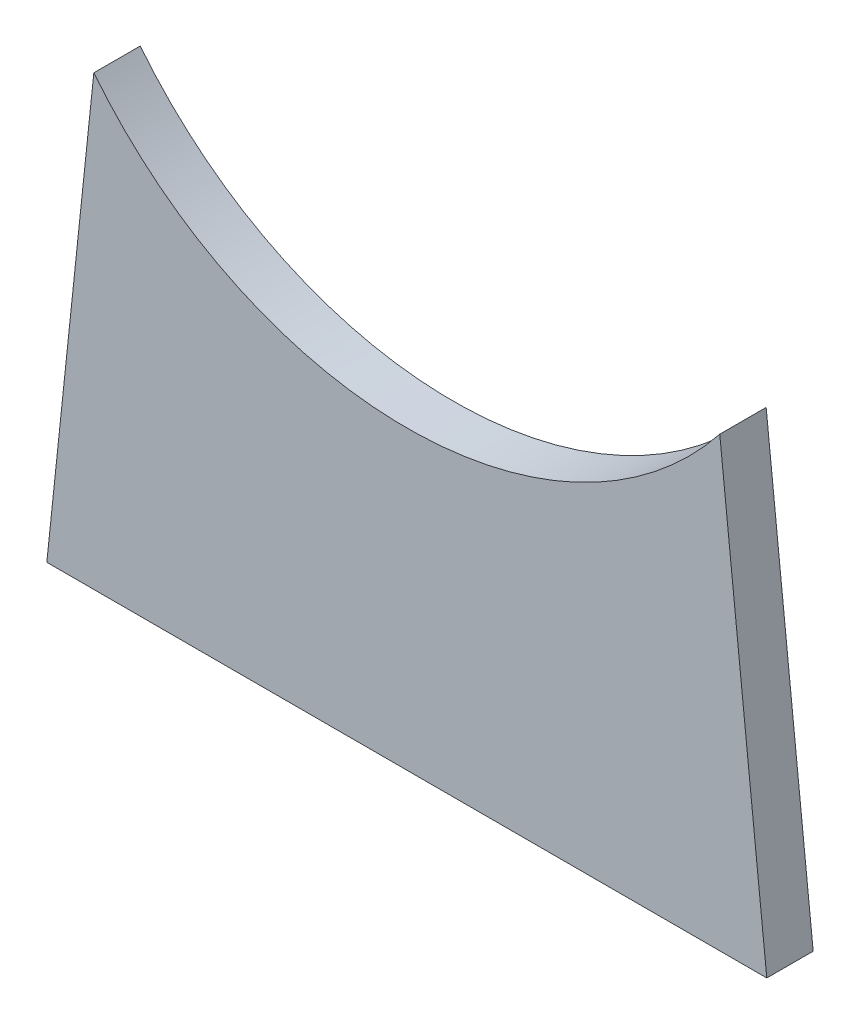
ISO-10303-21;
HEADER;
FILE_DESCRIPTION(('STEP AP214'),'2;1');
FILE_NAME('part.step','',(''),(''),'','','');
FILE_SCHEMA(('AUTOMOTIVE_DESIGN { 1 0 10303 214 1 1 1 1 }'));
ENDSEC;
DATA;
#1=APPLICATION_CONTEXT('core data for automotive mechanical design processes');
#2=APPLICATION_PROTOCOL_DEFINITION('international standard','automotive_design',2000,#1);
#3=PRODUCT_CONTEXT('',#1,'mechanical');
#4=PRODUCT('Part','Part','',(#3));
#5=PRODUCT_RELATED_PRODUCT_CATEGORY('part','',(#4));
#6=PRODUCT_DEFINITION_FORMATION('','',#4);
#7=PRODUCT_DEFINITION_CONTEXT('part definition',#1,'design');
#8=PRODUCT_DEFINITION('design','',#6,#7);
#9=PRODUCT_DEFINITION_SHAPE('','',#8);
#10=(LENGTH_UNIT() NAMED_UNIT(*) SI_UNIT(.MILLI.,.METRE.));
#11=(NAMED_UNIT(*) PLANE_ANGLE_UNIT() SI_UNIT($,.RADIAN.));
#12=(NAMED_UNIT(*) SI_UNIT($,.STERADIAN.) SOLID_ANGLE_UNIT());
#13=UNCERTAINTY_MEASURE_WITH_UNIT(LENGTH_MEASURE(1.E-05),#10,'distance_accuracy_value','');
#14=(GEOMETRIC_REPRESENTATION_CONTEXT(3) GLOBAL_UNCERTAINTY_ASSIGNED_CONTEXT((#13)) GLOBAL_UNIT_ASSIGNED_CONTEXT((#10,
#11,#12)) REPRESENTATION_CONTEXT('',''));
#15=CARTESIAN_POINT('',(0.,0.,0.));
#16=DIRECTION('',(0.,0.,1.));
#17=DIRECTION('',(1.,0.,0.));
#18=AXIS2_PLACEMENT_3D('',#15,#16,#17);
#19=CARTESIAN_POINT('',(-1978.13,0.,127.5));
#20=DIRECTION('',(0.994521895368273,-0.104528463267658,0.));
#21=DIRECTION('',(0.104528463267658,0.994521895368273,0.));
#22=AXIS2_PLACEMENT_3D('',#19,#20,#21);
#23=PLANE('',#22);
#24=DIRECTION('',(-0.104528463267658,-0.994521895368273,0.));
#25=VECTOR('',#24,1.);
#26=CARTESIAN_POINT('',(-1978.13,0.,-127.5));
#27=LINE('',#26,#25);
#28=CARTESIAN_POINT('',(-1719.70496154051,2458.75,-127.5));
#29=VERTEX_POINT('',#28);
#30=CARTESIAN_POINT('',(-1978.13,0.,-127.5));
#31=VERTEX_POINT('',#30);
#32=EDGE_CURVE('E107',#29,#31,#27,.T.);
#33=ORIENTED_EDGE('',*,*,#32,.T.);
#34=DIRECTION('',(0.,0.,-1.));
#35=VECTOR('',#34,1.);
#36=CARTESIAN_POINT('',(-1978.13,0.,127.5));
#37=LINE('',#36,#35);
#38=CARTESIAN_POINT('',(-1978.13,0.,127.5));
#39=VERTEX_POINT('',#38);
#40=EDGE_CURVE('E11',#39,#31,#37,.T.);
#41=ORIENTED_EDGE('',*,*,#40,.F.);
#42=DIRECTION('',(-0.104528463267658,-0.994521895368273,0.));
#43=VECTOR('',#42,1.);
#44=CARTESIAN_POINT('',(-1978.13,0.,127.5));
#45=LINE('',#44,#43);
#46=CARTESIAN_POINT('',(-1719.70496154051,2458.75,127.5));
#47=VERTEX_POINT('',#46);
#48=EDGE_CURVE('E91',#47,#39,#45,.T.);
#49=ORIENTED_EDGE('',*,*,#48,.F.);
#50=DIRECTION('',(0.,0.,-1.));
#51=VECTOR('',#50,1.);
#52=CARTESIAN_POINT('',(-1719.70496154051,2458.75,127.5));
#53=LINE('',#52,#51);
#54=EDGE_CURVE('E103',#47,#29,#53,.T.);
#55=ORIENTED_EDGE('',*,*,#54,.T.);
#56=EDGE_LOOP('',(#33,#41,#49,#55));
#57=FACE_BOUND('',#56,.T.);
#58=ADVANCED_FACE('F39',(#57),#23,.F.);
#59=CARTESIAN_POINT('',(-1978.13,0.,127.5));
#60=DIRECTION('',(0.,1.,0.));
#61=DIRECTION('',(-1.,0.,0.));
#62=AXIS2_PLACEMENT_3D('',#59,#60,#61);
#63=PLANE('',#62);
#64=DIRECTION('',(1.,0.,0.));
#65=VECTOR('',#64,1.);
#66=CARTESIAN_POINT('',(-1978.13,0.,-127.5));
#67=LINE('',#66,#65);
#68=CARTESIAN_POINT('',(1978.13,4.84502114559471E-13,-127.5));
#69=VERTEX_POINT('',#68);
#70=EDGE_CURVE('E96',#31,#69,#67,.T.);
#71=ORIENTED_EDGE('',*,*,#70,.T.);
#72=DIRECTION('',(0.,0.,-1.));
#73=VECTOR('',#72,1.);
#74=CARTESIAN_POINT('',(1978.13,4.84502114559471E-13,127.5));
#75=LINE('',#74,#73);
#76=CARTESIAN_POINT('',(1978.13,4.84502114559471E-13,127.5));
#77=VERTEX_POINT('',#76);
#78=EDGE_CURVE('E48',#77,#69,#75,.T.);
#79=ORIENTED_EDGE('',*,*,#78,.F.);
#80=DIRECTION('',(1.,0.,0.));
#81=VECTOR('',#80,1.);
#82=CARTESIAN_POINT('',(-1978.13,0.,127.5));
#83=LINE('',#82,#81);
#84=EDGE_CURVE('E86',#39,#77,#83,.T.);
#85=ORIENTED_EDGE('',*,*,#84,.F.);
#86=ORIENTED_EDGE('',*,*,#40,.T.);
#87=EDGE_LOOP('',(#71,#79,#85,#86));
#88=FACE_BOUND('',#87,.T.);
#89=ADVANCED_FACE('F95',(#88),#63,.F.);
#90=CARTESIAN_POINT('',(1978.13,4.84502114559471E-13,127.5));
#91=DIRECTION('',(-0.994521895368273,-0.104528463267658,0.));
#92=DIRECTION('',(0.104528463267658,-0.994521895368273,0.));
#93=AXIS2_PLACEMENT_3D('',#90,#91,#92);
#94=PLANE('',#93);
#95=DIRECTION('',(-0.104528463267658,0.994521895368273,0.));
#96=VECTOR('',#95,1.);
#97=CARTESIAN_POINT('',(1978.13,4.84502114559471E-13,-127.5));
#98=LINE('',#97,#96);
#99=CARTESIAN_POINT('',(1719.70496154051,2458.75,-127.5));
#100=VERTEX_POINT('',#99);
#101=EDGE_CURVE('E73',#69,#100,#98,.T.);
#102=ORIENTED_EDGE('',*,*,#101,.T.);
#103=DIRECTION('',(0.,0.,-1.));
#104=VECTOR('',#103,1.);
#105=CARTESIAN_POINT('',(1719.70496154051,2458.75,127.5));
#106=LINE('',#105,#104);
#107=CARTESIAN_POINT('',(1719.70496154051,2458.75,127.5));
#108=VERTEX_POINT('',#107);
#109=EDGE_CURVE('E98',#108,#100,#106,.T.);
#110=ORIENTED_EDGE('',*,*,#109,.F.);
#111=DIRECTION('',(-0.104528463267658,0.994521895368273,0.));
#112=VECTOR('',#111,1.);
#113=CARTESIAN_POINT('',(1978.13,4.84502114559471E-13,127.5));
#114=LINE('',#113,#112);
#115=EDGE_CURVE('E89',#77,#108,#114,.T.);
#116=ORIENTED_EDGE('',*,*,#115,.F.);
#117=ORIENTED_EDGE('',*,*,#78,.T.);
#118=EDGE_LOOP('',(#102,#110,#116,#117));
#119=FACE_BOUND('',#118,.T.);
#120=ADVANCED_FACE('F99',(#119),#94,.F.);
#121=CARTESIAN_POINT('',(2.22044604925031E-13,3824.44348158837,127.5));
#122=DIRECTION('',(0.,0.,-1.));
#123=DIRECTION('',(-1.,0.,0.));
#124=AXIS2_PLACEMENT_3D('',#121,#122,#123);
#125=CYLINDRICAL_SURFACE('',#124,2196.02);
#126=CARTESIAN_POINT('',(2.22044604925031E-13,3824.44348158837,-127.5));
#127=DIRECTION('',(0.,0.,-1.));
#128=DIRECTION('',(1.,0.,0.));
#129=AXIS2_PLACEMENT_3D('',#126,#127,#128);
#130=CIRCLE('',#129,2196.02);
#131=EDGE_CURVE('E79',#100,#29,#130,.T.);
#132=ORIENTED_EDGE('',*,*,#131,.T.);
#133=ORIENTED_EDGE('',*,*,#54,.F.);
#134=CARTESIAN_POINT('',(2.22044604925031E-13,3824.44348158837,127.5));
#135=DIRECTION('',(0.,0.,-1.));
#136=DIRECTION('',(1.,0.,0.));
#137=AXIS2_PLACEMENT_3D('',#134,#135,#136);
#138=CIRCLE('',#137,2196.02);
#139=EDGE_CURVE('E56',#108,#47,#138,.T.);
#140=ORIENTED_EDGE('',*,*,#139,.F.);
#141=ORIENTED_EDGE('',*,*,#109,.T.);
#142=EDGE_LOOP('',(#132,#133,#140,#141));
#143=FACE_BOUND('',#142,.T.);
#144=ADVANCED_FACE('F120',(#143),#125,.F.);
#145=CARTESIAN_POINT('',(2.22044604925031E-13,3824.44348158837,127.5));
#146=DIRECTION('',(0.,0.,1.));
#147=DIRECTION('',(1.,0.,0.));
#148=AXIS2_PLACEMENT_3D('',#145,#146,#147);
#149=PLANE('',#148);
#150=ORIENTED_EDGE('',*,*,#48,.T.);
#151=ORIENTED_EDGE('',*,*,#84,.T.);
#152=ORIENTED_EDGE('',*,*,#115,.T.);
#153=ORIENTED_EDGE('',*,*,#139,.T.);
#154=EDGE_LOOP('',(#150,#151,#152,#153));
#155=FACE_BOUND('',#154,.T.);
#156=ADVANCED_FACE('F87',(#155),#149,.T.);
#157=CARTESIAN_POINT('',(2.22044604925031E-13,3824.44348158837,-127.5));
#158=DIRECTION('',(0.,0.,1.));
#159=DIRECTION('',(1.,0.,0.));
#160=AXIS2_PLACEMENT_3D('',#157,#158,#159);
#161=PLANE('',#160);
#162=ORIENTED_EDGE('',*,*,#32,.F.);
#163=ORIENTED_EDGE('',*,*,#131,.F.);
#164=ORIENTED_EDGE('',*,*,#101,.F.);
#165=ORIENTED_EDGE('',*,*,#70,.F.);
#166=EDGE_LOOP('',(#162,#163,#164,#165));
#167=FACE_BOUND('',#166,.T.);
#168=ADVANCED_FACE('F123',(#167),#161,.F.);
#169=CLOSED_SHELL('',(#58,#89,#120,#144,#156,#168));
#170=MANIFOLD_SOLID_BREP('B2',#169);
#171=ADVANCED_BREP_SHAPE_REPRESENTATION('',(#18,#170),#14);
#172=SHAPE_DEFINITION_REPRESENTATION(#9,#171);
ENDSEC;
END-ISO-10303-21;
